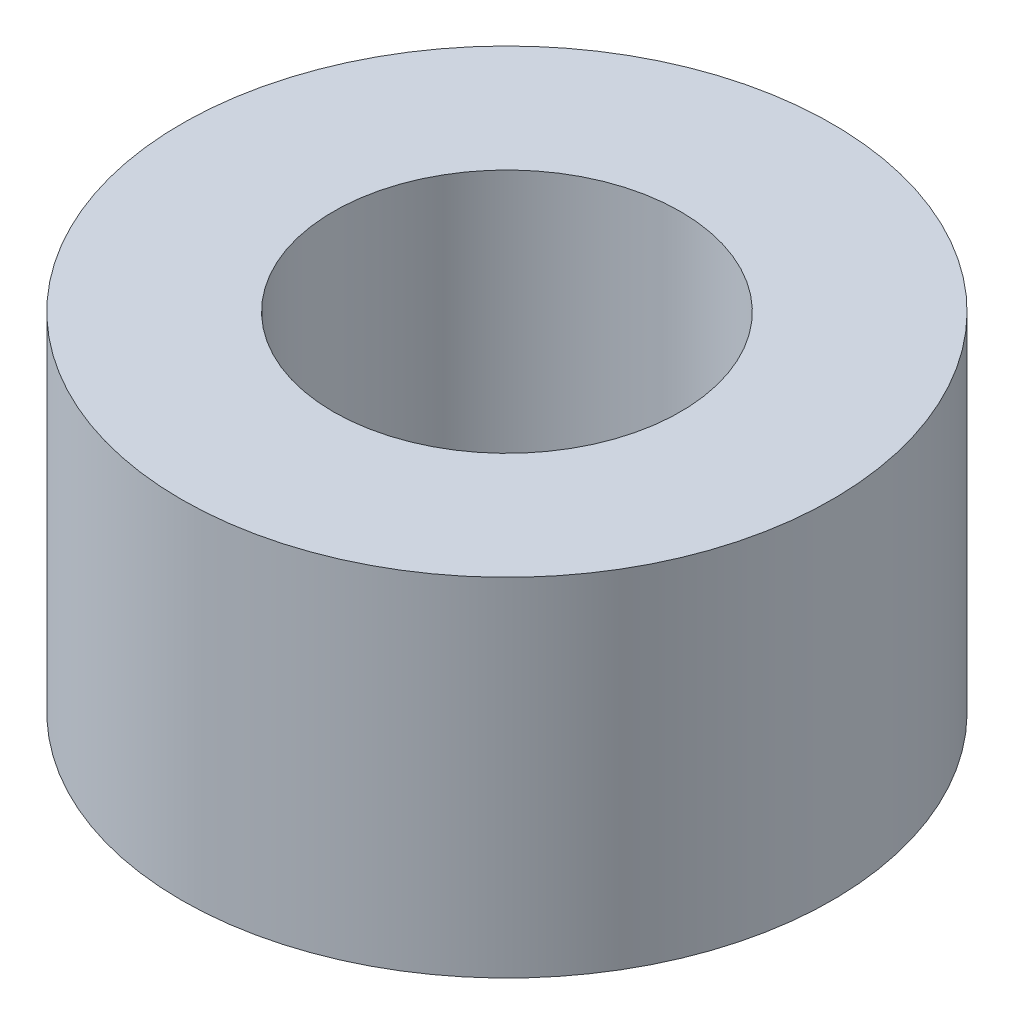
ISO-10303-21;
HEADER;
FILE_DESCRIPTION(('STEP AP214'),'2;1');
FILE_NAME('part.step','',(''),(''),'','','');
FILE_SCHEMA(('AUTOMOTIVE_DESIGN { 1 0 10303 214 1 1 1 1 }'));
ENDSEC;
DATA;
#1=APPLICATION_CONTEXT('core data for automotive mechanical design processes');
#2=APPLICATION_PROTOCOL_DEFINITION('international standard','automotive_design',2000,#1);
#3=PRODUCT_CONTEXT('',#1,'mechanical');
#4=PRODUCT('Part','Part','',(#3));
#5=PRODUCT_RELATED_PRODUCT_CATEGORY('part','',(#4));
#6=PRODUCT_DEFINITION_FORMATION('','',#4);
#7=PRODUCT_DEFINITION_CONTEXT('part definition',#1,'design');
#8=PRODUCT_DEFINITION('design','',#6,#7);
#9=PRODUCT_DEFINITION_SHAPE('','',#8);
#10=(LENGTH_UNIT() NAMED_UNIT(*) SI_UNIT(.MILLI.,.METRE.));
#11=(NAMED_UNIT(*) PLANE_ANGLE_UNIT() SI_UNIT($,.RADIAN.));
#12=(NAMED_UNIT(*) SI_UNIT($,.STERADIAN.) SOLID_ANGLE_UNIT());
#13=UNCERTAINTY_MEASURE_WITH_UNIT(LENGTH_MEASURE(1.E-05),#10,'distance_accuracy_value','');
#14=(GEOMETRIC_REPRESENTATION_CONTEXT(3) GLOBAL_UNCERTAINTY_ASSIGNED_CONTEXT((#13)) GLOBAL_UNIT_ASSIGNED_CONTEXT((#10,
#11,#12)) REPRESENTATION_CONTEXT('',''));
#15=CARTESIAN_POINT('',(0.,0.,0.));
#16=DIRECTION('',(0.,0.,1.));
#17=DIRECTION('',(1.,0.,0.));
#18=AXIS2_PLACEMENT_3D('',#15,#16,#17);
#19=CARTESIAN_POINT('',(0.,8.,0.));
#20=DIRECTION('',(0.,-1.,0.));
#21=DIRECTION('',(0.,0.,-1.));
#22=AXIS2_PLACEMENT_3D('',#19,#20,#21);
#23=CYLINDRICAL_SURFACE('',#22,7.5);
#24=CARTESIAN_POINT('',(0.,8.,0.));
#25=DIRECTION('',(0.,1.,0.));
#26=DIRECTION('',(0.,0.,1.));
#27=AXIS2_PLACEMENT_3D('',#24,#25,#26);
#28=CIRCLE('',#27,7.5);
#29=CARTESIAN_POINT('',(0.,8.,7.5));
#30=VERTEX_POINT('',#29);
#31=EDGE_CURVE('E10',#30,#30,#28,.T.);
#32=ORIENTED_EDGE('',*,*,#31,.F.);
#33=EDGE_LOOP('',(#32));
#34=FACE_BOUND('',#33,.T.);
#35=CARTESIAN_POINT('',(0.,0.,0.));
#36=DIRECTION('',(0.,1.,0.));
#37=DIRECTION('',(0.,0.,1.));
#38=AXIS2_PLACEMENT_3D('',#35,#36,#37);
#39=CIRCLE('',#38,7.5);
#40=CARTESIAN_POINT('',(0.,0.,7.5));
#41=VERTEX_POINT('',#40);
#42=EDGE_CURVE('E37',#41,#41,#39,.T.);
#43=ORIENTED_EDGE('',*,*,#42,.T.);
#44=EDGE_LOOP('',(#43));
#45=FACE_BOUND('',#44,.T.);
#46=ADVANCED_FACE('F30',(#34,#45),#23,.T.);
#47=CARTESIAN_POINT('',(0.,8.,0.));
#48=DIRECTION('',(0.,1.,0.));
#49=DIRECTION('',(0.,0.,1.));
#50=AXIS2_PLACEMENT_3D('',#47,#48,#49);
#51=PLANE('',#50);
#52=CARTESIAN_POINT('',(0.,8.,0.));
#53=DIRECTION('',(0.,1.,0.));
#54=DIRECTION('',(0.,0.,1.));
#55=AXIS2_PLACEMENT_3D('',#52,#53,#54);
#56=CIRCLE('',#55,4.);
#57=CARTESIAN_POINT('',(0.,8.,4.));
#58=VERTEX_POINT('',#57);
#59=EDGE_CURVE('E44',#58,#58,#56,.T.);
#60=ORIENTED_EDGE('',*,*,#59,.F.);
#61=EDGE_LOOP('',(#60));
#62=FACE_BOUND('',#61,.T.);
#63=ORIENTED_EDGE('',*,*,#31,.T.);
#64=EDGE_LOOP('',(#63));
#65=FACE_BOUND('',#64,.T.);
#66=ADVANCED_FACE('F71',(#62,#65),#51,.T.);
#67=CARTESIAN_POINT('',(0.,0.,0.));
#68=DIRECTION('',(0.,1.,0.));
#69=DIRECTION('',(0.,0.,1.));
#70=AXIS2_PLACEMENT_3D('',#67,#68,#69);
#71=PLANE('',#70);
#72=CARTESIAN_POINT('',(0.,0.,0.));
#73=DIRECTION('',(0.,-1.,0.));
#74=DIRECTION('',(0.,0.,-1.));
#75=AXIS2_PLACEMENT_3D('',#72,#73,#74);
#76=CIRCLE('',#75,1.075);
#77=CARTESIAN_POINT('',(0.,0.,-1.075));
#78=VERTEX_POINT('',#77);
#79=EDGE_CURVE('E49',#78,#78,#76,.T.);
#80=ORIENTED_EDGE('',*,*,#79,.F.);
#81=EDGE_LOOP('',(#80));
#82=FACE_BOUND('',#81,.T.);
#83=ORIENTED_EDGE('',*,*,#42,.F.);
#84=EDGE_LOOP('',(#83));
#85=FACE_BOUND('',#84,.T.);
#86=ADVANCED_FACE('F67',(#82,#85),#71,.F.);
#87=CARTESIAN_POINT('',(0.,2.,0.));
#88=DIRECTION('',(0.,1.,0.));
#89=DIRECTION('',(0.,0.,1.));
#90=AXIS2_PLACEMENT_3D('',#87,#88,#89);
#91=CYLINDRICAL_SURFACE('',#90,4.);
#92=CARTESIAN_POINT('',(0.,2.,0.));
#93=DIRECTION('',(0.,1.,0.));
#94=DIRECTION('',(0.,0.,1.));
#95=AXIS2_PLACEMENT_3D('',#92,#93,#94);
#96=CIRCLE('',#95,4.);
#97=CARTESIAN_POINT('',(0.,2.,4.));
#98=VERTEX_POINT('',#97);
#99=EDGE_CURVE('E42',#98,#98,#96,.T.);
#100=ORIENTED_EDGE('',*,*,#99,.F.);
#101=EDGE_LOOP('',(#100));
#102=FACE_BOUND('',#101,.T.);
#103=ORIENTED_EDGE('',*,*,#59,.T.);
#104=EDGE_LOOP('',(#103));
#105=FACE_BOUND('',#104,.T.);
#106=ADVANCED_FACE('F61',(#102,#105),#91,.F.);
#107=CARTESIAN_POINT('',(0.,2.,0.));
#108=DIRECTION('',(0.,1.,0.));
#109=DIRECTION('',(0.,0.,1.));
#110=AXIS2_PLACEMENT_3D('',#107,#108,#109);
#111=PLANE('',#110);
#112=CARTESIAN_POINT('',(0.,2.,0.));
#113=DIRECTION('',(0.,1.,0.));
#114=DIRECTION('',(0.,0.,1.));
#115=AXIS2_PLACEMENT_3D('',#112,#113,#114);
#116=CIRCLE('',#115,1.075);
#117=CARTESIAN_POINT('',(0.,2.,1.075));
#118=VERTEX_POINT('',#117);
#119=EDGE_CURVE('E33',#118,#118,#116,.T.);
#120=ORIENTED_EDGE('',*,*,#119,.F.);
#121=EDGE_LOOP('',(#120));
#122=FACE_BOUND('',#121,.T.);
#123=ORIENTED_EDGE('',*,*,#99,.T.);
#124=EDGE_LOOP('',(#123));
#125=FACE_BOUND('',#124,.T.);
#126=ADVANCED_FACE('F58',(#122,#125),#111,.T.);
#127=CARTESIAN_POINT('',(0.,6.,0.));
#128=DIRECTION('',(0.,-1.,0.));
#129=DIRECTION('',(0.,0.,-1.));
#130=AXIS2_PLACEMENT_3D('',#127,#128,#129);
#131=CYLINDRICAL_SURFACE('',#130,1.075);
#132=ORIENTED_EDGE('',*,*,#119,.T.);
#133=EDGE_LOOP('',(#132));
#134=FACE_BOUND('',#133,.T.);
#135=ORIENTED_EDGE('',*,*,#79,.T.);
#136=EDGE_LOOP('',(#135));
#137=FACE_BOUND('',#136,.T.);
#138=ADVANCED_FACE('F56',(#134,#137),#131,.F.);
#139=CLOSED_SHELL('',(#46,#66,#86,#106,#126,#138));
#140=MANIFOLD_SOLID_BREP('B2',#139);
#141=ADVANCED_BREP_SHAPE_REPRESENTATION('',(#18,#140),#14);
#142=SHAPE_DEFINITION_REPRESENTATION(#9,#141);
ENDSEC;
END-ISO-10303-21;
